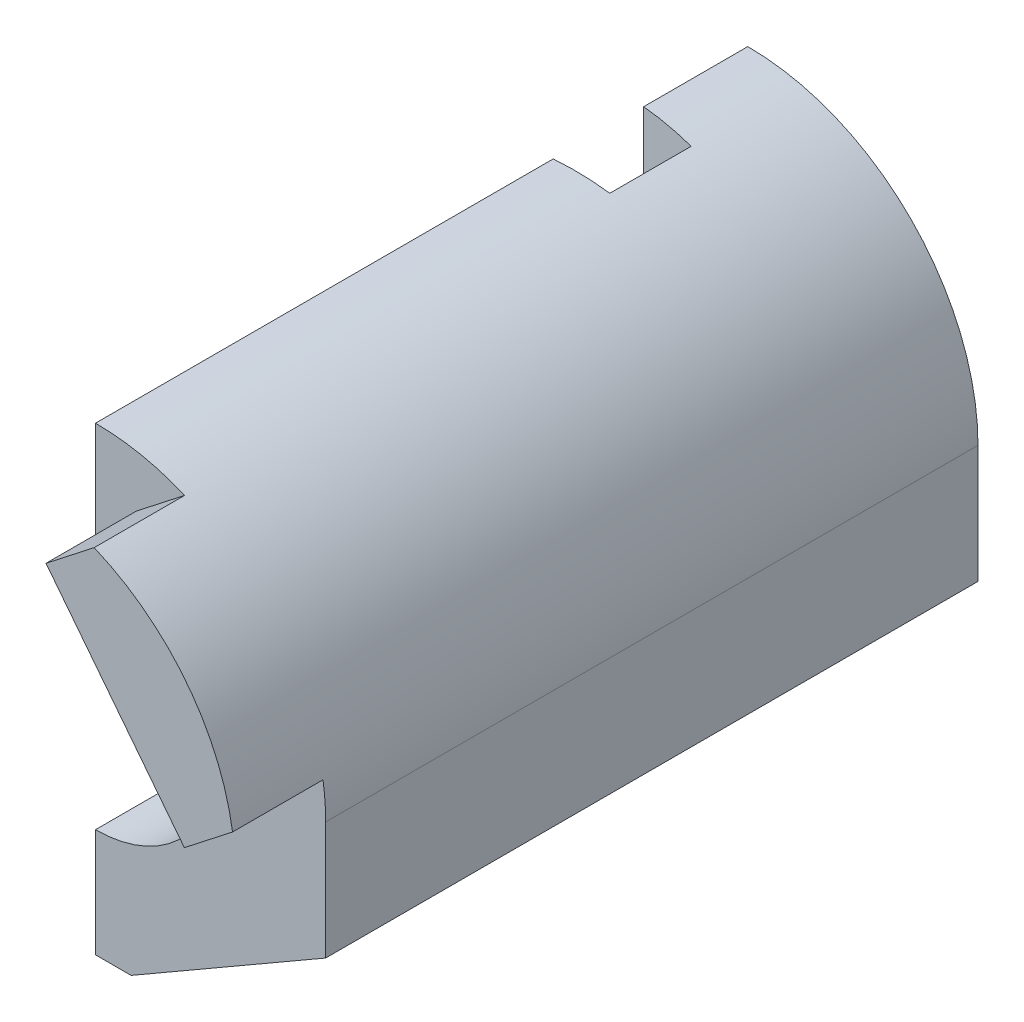
ISO-10303-21;
HEADER;
FILE_DESCRIPTION(('STEP AP214'),'2;1');
FILE_NAME('part.step','',(''),(''),'','','');
FILE_SCHEMA(('AUTOMOTIVE_DESIGN { 1 0 10303 214 1 1 1 1 }'));
ENDSEC;
DATA;
#1=APPLICATION_CONTEXT('core data for automotive mechanical design processes');
#2=APPLICATION_PROTOCOL_DEFINITION('international standard','automotive_design',2000,#1);
#3=PRODUCT_CONTEXT('',#1,'mechanical');
#4=PRODUCT('Part','Part','',(#3));
#5=PRODUCT_RELATED_PRODUCT_CATEGORY('part','',(#4));
#6=PRODUCT_DEFINITION_FORMATION('','',#4);
#7=PRODUCT_DEFINITION_CONTEXT('part definition',#1,'design');
#8=PRODUCT_DEFINITION('design','',#6,#7);
#9=PRODUCT_DEFINITION_SHAPE('','',#8);
#10=(LENGTH_UNIT() NAMED_UNIT(*) SI_UNIT(.MILLI.,.METRE.));
#11=(NAMED_UNIT(*) PLANE_ANGLE_UNIT() SI_UNIT($,.RADIAN.));
#12=(NAMED_UNIT(*) SI_UNIT($,.STERADIAN.) SOLID_ANGLE_UNIT());
#13=UNCERTAINTY_MEASURE_WITH_UNIT(LENGTH_MEASURE(1.E-05),#10,'distance_accuracy_value','');
#14=(GEOMETRIC_REPRESENTATION_CONTEXT(3) GLOBAL_UNCERTAINTY_ASSIGNED_CONTEXT((#13)) GLOBAL_UNIT_ASSIGNED_CONTEXT((#10,
#11,#12)) REPRESENTATION_CONTEXT('',''));
#15=CARTESIAN_POINT('',(0.,0.,0.));
#16=DIRECTION('',(0.,0.,1.));
#17=DIRECTION('',(1.,0.,0.));
#18=AXIS2_PLACEMENT_3D('',#15,#16,#17);
#19=CARTESIAN_POINT('',(20.,0.,238.));
#20=DIRECTION('',(0.,0.,-1.));
#21=DIRECTION('',(1.,0.,0.));
#22=AXIS2_PLACEMENT_3D('',#19,#20,#21);
#23=PLANE('',#22);
#24=DIRECTION('',(0.788010753606725,0.615661475325655,0.));
#25=VECTOR('',#24,1.);
#26=CARTESIAN_POINT('',(34.9464279455912,63.7071761394841,238.));
#27=LINE('',#26,#25);
#28=CARTESIAN_POINT('',(34.9464279455912,63.7071761394841,238.));
#29=VERTEX_POINT('',#28);
#30=CARTESIAN_POINT('',(52.5304084023254,77.4452873271054,238.));
#31=VERTEX_POINT('',#30);
#32=EDGE_CURVE('E204',#29,#31,#27,.T.);
#33=ORIENTED_EDGE('',*,*,#32,.T.);
#34=CARTESIAN_POINT('',(20.,0.,238.));
#35=DIRECTION('',(0.,0.,-1.));
#36=DIRECTION('',(1.,0.,0.));
#37=AXIS2_PLACEMENT_3D('',#34,#35,#36);
#38=CIRCLE('',#37,84.);
#39=CARTESIAN_POINT('',(20.,84.,238.));
#40=VERTEX_POINT('',#39);
#41=EDGE_CURVE('E284',#40,#31,#38,.T.);
#42=ORIENTED_EDGE('',*,*,#41,.F.);
#43=DIRECTION('',(0.,1.,0.));
#44=VECTOR('',#43,1.);
#45=CARTESIAN_POINT('',(20.,28.575,238.));
#46=LINE('',#45,#44);
#47=CARTESIAN_POINT('',(20.,44.45,238.));
#48=VERTEX_POINT('',#47);
#49=EDGE_CURVE('E280',#48,#40,#46,.T.);
#50=ORIENTED_EDGE('',*,*,#49,.F.);
#51=CARTESIAN_POINT('',(20.,0.,238.));
#52=DIRECTION('',(0.,0.,-1.));
#53=DIRECTION('',(-1.,0.,0.));
#54=AXIS2_PLACEMENT_3D('',#51,#52,#53);
#55=CIRCLE('',#54,44.45);
#56=CARTESIAN_POINT('',(20.,-44.45,238.));
#57=VERTEX_POINT('',#56);
#58=EDGE_CURVE('E255',#48,#57,#55,.T.);
#59=ORIENTED_EDGE('',*,*,#58,.T.);
#60=DIRECTION('',(0.,1.,0.));
#61=VECTOR('',#60,1.);
#62=CARTESIAN_POINT('',(20.,-84.,238.));
#63=LINE('',#62,#61);
#64=CARTESIAN_POINT('',(20.,-84.,238.));
#65=VERTEX_POINT('',#64);
#66=EDGE_CURVE('E277',#65,#57,#63,.T.);
#67=ORIENTED_EDGE('',*,*,#66,.F.);
#68=DIRECTION('',(-1.,0.,0.));
#69=VECTOR('',#68,1.);
#70=CARTESIAN_POINT('',(33.,-84.,238.));
#71=LINE('',#70,#69);
#72=CARTESIAN_POINT('',(33.,-84.,238.));
#73=VERTEX_POINT('',#72);
#74=EDGE_CURVE('E273',#73,#65,#71,.T.);
#75=ORIENTED_EDGE('',*,*,#74,.F.);
#76=DIRECTION('',(-0.866025403784442,-0.499999999999995,0.));
#77=VECTOR('',#76,1.);
#78=CARTESIAN_POINT('',(104.,-43.0081308875371,238.));
#79=LINE('',#78,#77);
#80=CARTESIAN_POINT('',(104.,-43.0081308875371,238.));
#81=VERTEX_POINT('',#80);
#82=EDGE_CURVE('E270',#81,#73,#79,.T.);
#83=ORIENTED_EDGE('',*,*,#82,.F.);
#84=DIRECTION('',(0.,-1.,0.));
#85=VECTOR('',#84,1.);
#86=CARTESIAN_POINT('',(104.,-43.0081308875371,238.));
#87=LINE('',#86,#85);
#88=CARTESIAN_POINT('',(104.,0.,238.));
#89=VERTEX_POINT('',#88);
#90=EDGE_CURVE('E286',#89,#81,#87,.T.);
#91=ORIENTED_EDGE('',*,*,#90,.F.);
#92=CARTESIAN_POINT('',(103.014649379029,12.8284055313539,238.));
#93=VERTEX_POINT('',#92);
#94=EDGE_CURVE('E283',#93,#89,#38,.T.);
#95=ORIENTED_EDGE('',*,*,#94,.F.);
#96=DIRECTION('',(-0.788010753606725,-0.615661475325655,0.));
#97=VECTOR('',#96,1.);
#98=CARTESIAN_POINT('',(103.014649379029,12.8284055313539,238.));
#99=LINE('',#98,#97);
#100=CARTESIAN_POINT('',(85.4306689222948,-0.909705656267424,238.));
#101=VERTEX_POINT('',#100);
#102=EDGE_CURVE('E196',#93,#101,#99,.T.);
#103=ORIENTED_EDGE('',*,*,#102,.T.);
#104=DIRECTION('',(-0.615661475325654,0.788010753606726,0.));
#105=VECTOR('',#104,1.);
#106=CARTESIAN_POINT('',(85.4306689222948,-0.909705656267424,238.));
#107=LINE('',#106,#105);
#108=EDGE_CURVE('E207',#101,#29,#107,.T.);
#109=ORIENTED_EDGE('',*,*,#108,.T.);
#110=EDGE_LOOP('',(#33,#42,#50,#59,#67,#75,#83,#91,#95,#103,#109));
#111=FACE_BOUND('',#110,.T.);
#112=ADVANCED_FACE('F40',(#111),#23,.F.);
#113=CARTESIAN_POINT('',(20.,28.575,238.));
#114=DIRECTION('',(1.,0.,0.));
#115=DIRECTION('',(0.,0.,1.));
#116=AXIS2_PLACEMENT_3D('',#113,#114,#115);
#117=PLANE('',#116);
#118=DIRECTION('',(0.,0.,-1.));
#119=VECTOR('',#118,1.);
#120=CARTESIAN_POINT('',(20.,28.575,238.));
#121=LINE('',#120,#119);
#122=CARTESIAN_POINT('',(20.,28.575,160.));
#123=VERTEX_POINT('',#122);
#124=CARTESIAN_POINT('',(20.,28.575,71.));
#125=VERTEX_POINT('',#124);
#126=EDGE_CURVE('E319',#123,#125,#121,.T.);
#127=ORIENTED_EDGE('',*,*,#126,.F.);
#128=DIRECTION('',(0.,1.,0.));
#129=VECTOR('',#128,1.);
#130=CARTESIAN_POINT('',(20.,28.575,160.));
#131=LINE('',#130,#129);
#132=CARTESIAN_POINT('',(20.,44.45,160.));
#133=VERTEX_POINT('',#132);
#134=EDGE_CURVE('E331',#123,#133,#131,.T.);
#135=ORIENTED_EDGE('',*,*,#134,.T.);
#136=DIRECTION('',(0.,0.,1.));
#137=VECTOR('',#136,1.);
#138=CARTESIAN_POINT('',(20.,44.45,160.));
#139=LINE('',#138,#137);
#140=EDGE_CURVE('E258',#48,#133,#139,.F.);
#141=ORIENTED_EDGE('',*,*,#140,.F.);
#142=ORIENTED_EDGE('',*,*,#49,.T.);
#143=DIRECTION('',(0.,0.,-1.));
#144=VECTOR('',#143,1.);
#145=CARTESIAN_POINT('',(20.,84.,238.));
#146=LINE('',#145,#144);
#147=CARTESIAN_POINT('',(20.,84.,71.));
#148=VERTEX_POINT('',#147);
#149=EDGE_CURVE('E315',#40,#148,#146,.T.);
#150=ORIENTED_EDGE('',*,*,#149,.T.);
#151=DIRECTION('',(0.,-1.,0.));
#152=VECTOR('',#151,1.);
#153=CARTESIAN_POINT('',(20.,86.,71.));
#154=LINE('',#153,#152);
#155=EDGE_CURVE('E236',#148,#125,#154,.T.);
#156=ORIENTED_EDGE('',*,*,#155,.T.);
#157=EDGE_LOOP('',(#127,#135,#141,#142,#150,#156));
#158=FACE_BOUND('',#157,.T.);
#159=ADVANCED_FACE('F403',(#158),#117,.F.);
#160=CARTESIAN_POINT('',(20.,0.,238.));
#161=DIRECTION('',(0.,0.,-1.));
#162=DIRECTION('',(1.,0.,0.));
#163=AXIS2_PLACEMENT_3D('',#160,#161,#162);
#164=CYLINDRICAL_SURFACE('',#163,28.575);
#165=DIRECTION('',(0.,0.,-1.));
#166=VECTOR('',#165,1.);
#167=CARTESIAN_POINT('',(39.,21.3431634253219,238.));
#168=LINE('',#167,#166);
#169=CARTESIAN_POINT('',(39.,21.3431634253219,69.3377153930074));
#170=VERTEX_POINT('',#169);
#171=CARTESIAN_POINT('',(39.,21.3431634253219,39.6622846069926));
#172=VERTEX_POINT('',#171);
#173=EDGE_CURVE('E247',#170,#172,#168,.T.);
#174=ORIENTED_EDGE('',*,*,#173,.T.);
#175=CARTESIAN_POINT('',(20.,0.,38.));
#176=DIRECTION('',(-0.0871557427476584,0.,0.996194698091746));
#177=DIRECTION('',(-0.996194698091746,0.,-0.0871557427476584));
#178=AXIS2_PLACEMENT_3D('',#175,#176,#177);
#179=ELLIPSE('',#178,28.6841518578012,28.575);
#180=CARTESIAN_POINT('',(20.,28.575,38.));
#181=VERTEX_POINT('',#180);
#182=EDGE_CURVE('E250',#181,#172,#179,.F.);
#183=ORIENTED_EDGE('',*,*,#182,.F.);
#184=CARTESIAN_POINT('',(20.,28.575,0.));
#185=VERTEX_POINT('',#184);
#186=EDGE_CURVE('E318',#181,#185,#121,.T.);
#187=ORIENTED_EDGE('',*,*,#186,.T.);
#188=CARTESIAN_POINT('',(20.,0.,0.));
#189=DIRECTION('',(0.,0.,1.));
#190=DIRECTION('',(1.,0.,0.));
#191=AXIS2_PLACEMENT_3D('',#188,#189,#190);
#192=CIRCLE('',#191,28.575);
#193=CARTESIAN_POINT('',(20.,-28.575,0.));
#194=VERTEX_POINT('',#193);
#195=EDGE_CURVE('E299',#194,#185,#192,.T.);
#196=ORIENTED_EDGE('',*,*,#195,.F.);
#197=DIRECTION('',(0.,0.,-1.));
#198=VECTOR('',#197,1.);
#199=CARTESIAN_POINT('',(20.,-28.575,238.));
#200=LINE('',#199,#198);
#201=CARTESIAN_POINT('',(20.,-28.575,160.));
#202=VERTEX_POINT('',#201);
#203=EDGE_CURVE('E322',#202,#194,#200,.T.);
#204=ORIENTED_EDGE('',*,*,#203,.F.);
#205=CARTESIAN_POINT('',(20.,0.,160.));
#206=DIRECTION('',(0.,0.,-1.));
#207=DIRECTION('',(-1.,0.,0.));
#208=AXIS2_PLACEMENT_3D('',#205,#206,#207);
#209=CIRCLE('',#208,28.575);
#210=EDGE_CURVE('E265',#202,#123,#209,.F.);
#211=ORIENTED_EDGE('',*,*,#210,.T.);
#212=ORIENTED_EDGE('',*,*,#126,.T.);
#213=CARTESIAN_POINT('',(20.,0.,71.));
#214=DIRECTION('',(-0.0871557427476584,0.,-0.996194698091746));
#215=DIRECTION('',(0.996194698091746,0.,-0.0871557427476584));
#216=AXIS2_PLACEMENT_3D('',#213,#214,#215);
#217=ELLIPSE('',#216,28.6841518578012,28.575);
#218=EDGE_CURVE('E253',#170,#125,#217,.F.);
#219=ORIENTED_EDGE('',*,*,#218,.F.);
#220=EDGE_LOOP('',(#174,#183,#187,#196,#204,#211,#212,#219));
#221=FACE_BOUND('',#220,.T.);
#222=ADVANCED_FACE('F370',(#221),#164,.F.);
#223=CARTESIAN_POINT('',(104.,-43.0081308875371,238.));
#224=DIRECTION('',(-0.499999999999995,0.866025403784442,0.));
#225=DIRECTION('',(0.866025403784442,0.499999999999995,0.));
#226=AXIS2_PLACEMENT_3D('',#223,#224,#225);
#227=PLANE('',#226);
#228=DIRECTION('',(-0.866025403784442,-0.499999999999995,0.));
#229=VECTOR('',#228,1.);
#230=CARTESIAN_POINT('',(104.,-43.0081308875371,0.));
#231=LINE('',#230,#229);
#232=CARTESIAN_POINT('',(104.,-43.0081308875371,0.));
#233=VERTEX_POINT('',#232);
#234=CARTESIAN_POINT('',(33.,-84.,0.));
#235=VERTEX_POINT('',#234);
#236=EDGE_CURVE('E269',#233,#235,#231,.T.);
#237=ORIENTED_EDGE('',*,*,#236,.F.);
#238=DIRECTION('',(0.,0.,-1.));
#239=VECTOR('',#238,1.);
#240=CARTESIAN_POINT('',(104.,-43.0081308875371,238.));
#241=LINE('',#240,#239);
#242=EDGE_CURVE('E289',#81,#233,#241,.T.);
#243=ORIENTED_EDGE('',*,*,#242,.F.);
#244=ORIENTED_EDGE('',*,*,#82,.T.);
#245=DIRECTION('',(0.,0.,-1.));
#246=VECTOR('',#245,1.);
#247=CARTESIAN_POINT('',(33.,-84.,238.));
#248=LINE('',#247,#246);
#249=EDGE_CURVE('E328',#73,#235,#248,.T.);
#250=ORIENTED_EDGE('',*,*,#249,.T.);
#251=EDGE_LOOP('',(#237,#243,#244,#250));
#252=FACE_BOUND('',#251,.T.);
#253=ADVANCED_FACE('F42',(#252),#227,.F.);
#254=CARTESIAN_POINT('',(33.,-84.,238.));
#255=DIRECTION('',(0.,1.,0.));
#256=DIRECTION('',(0.,0.,1.));
#257=AXIS2_PLACEMENT_3D('',#254,#255,#256);
#258=PLANE('',#257);
#259=DIRECTION('',(-1.,0.,0.));
#260=VECTOR('',#259,1.);
#261=CARTESIAN_POINT('',(33.,-84.,0.));
#262=LINE('',#261,#260);
#263=CARTESIAN_POINT('',(20.,-84.,0.));
#264=VERTEX_POINT('',#263);
#265=EDGE_CURVE('E292',#235,#264,#262,.T.);
#266=ORIENTED_EDGE('',*,*,#265,.F.);
#267=ORIENTED_EDGE('',*,*,#249,.F.);
#268=ORIENTED_EDGE('',*,*,#74,.T.);
#269=DIRECTION('',(0.,0.,-1.));
#270=VECTOR('',#269,1.);
#271=CARTESIAN_POINT('',(20.,-84.,238.));
#272=LINE('',#271,#270);
#273=EDGE_CURVE('E325',#65,#264,#272,.T.);
#274=ORIENTED_EDGE('',*,*,#273,.T.);
#275=EDGE_LOOP('',(#266,#267,#268,#274));
#276=FACE_BOUND('',#275,.T.);
#277=ADVANCED_FACE('F384',(#276),#258,.F.);
#278=CARTESIAN_POINT('',(20.,-84.,238.));
#279=DIRECTION('',(1.,0.,0.));
#280=DIRECTION('',(0.,0.,1.));
#281=AXIS2_PLACEMENT_3D('',#278,#279,#280);
#282=PLANE('',#281);
#283=CARTESIAN_POINT('',(20.,-58.,117.));
#284=DIRECTION('',(1.,0.,0.));
#285=DIRECTION('',(0.,1.,0.));
#286=AXIS2_PLACEMENT_3D('',#283,#284,#285);
#287=CIRCLE('',#286,11.);
#288=CARTESIAN_POINT('',(20.,-47.,117.));
#289=VERTEX_POINT('',#288);
#290=CARTESIAN_POINT('',(20.,-69.,117.));
#291=VERTEX_POINT('',#290);
#292=EDGE_CURVE('E198',#289,#291,#287,.T.);
#293=ORIENTED_EDGE('',*,*,#292,.T.);
#294=DIRECTION('',(0.,0.,-1.));
#295=VECTOR('',#294,1.);
#296=CARTESIAN_POINT('',(20.,-69.,117.));
#297=LINE('',#296,#295);
#298=CARTESIAN_POINT('',(20.,-69.,0.));
#299=VERTEX_POINT('',#298);
#300=EDGE_CURVE('E229',#291,#299,#297,.T.);
#301=ORIENTED_EDGE('',*,*,#300,.T.);
#302=DIRECTION('',(0.,1.,0.));
#303=VECTOR('',#302,1.);
#304=CARTESIAN_POINT('',(20.,-84.,0.));
#305=LINE('',#304,#303);
#306=EDGE_CURVE('E296',#264,#299,#305,.T.);
#307=ORIENTED_EDGE('',*,*,#306,.F.);
#308=ORIENTED_EDGE('',*,*,#273,.F.);
#309=ORIENTED_EDGE('',*,*,#66,.T.);
#310=DIRECTION('',(0.,0.,1.));
#311=VECTOR('',#310,1.);
#312=CARTESIAN_POINT('',(20.,-44.45,160.));
#313=LINE('',#312,#311);
#314=CARTESIAN_POINT('',(20.,-44.45,160.));
#315=VERTEX_POINT('',#314);
#316=EDGE_CURVE('E263',#315,#57,#313,.T.);
#317=ORIENTED_EDGE('',*,*,#316,.F.);
#318=DIRECTION('',(0.,1.,0.));
#319=VECTOR('',#318,1.);
#320=CARTESIAN_POINT('',(20.,-84.,160.));
#321=LINE('',#320,#319);
#322=EDGE_CURVE('E267',#315,#202,#321,.T.);
#323=ORIENTED_EDGE('',*,*,#322,.T.);
#324=ORIENTED_EDGE('',*,*,#203,.T.);
#325=CARTESIAN_POINT('',(20.,-47.,0.));
#326=VERTEX_POINT('',#325);
#327=EDGE_CURVE('E295',#326,#194,#305,.T.);
#328=ORIENTED_EDGE('',*,*,#327,.F.);
#329=DIRECTION('',(0.,0.,1.));
#330=VECTOR('',#329,1.);
#331=CARTESIAN_POINT('',(20.,-47.,117.));
#332=LINE('',#331,#330);
#333=EDGE_CURVE('E222',#326,#289,#332,.T.);
#334=ORIENTED_EDGE('',*,*,#333,.T.);
#335=EDGE_LOOP('',(#293,#301,#307,#308,#309,#317,#323,#324,#328,#334));
#336=FACE_BOUND('',#335,.T.);
#337=ADVANCED_FACE('F365',(#336),#282,.F.);
#338=CARTESIAN_POINT('',(20.,84.,38.));
#339=VERTEX_POINT('',#338);
#340=CARTESIAN_POINT('',(20.,84.,0.));
#341=VERTEX_POINT('',#340);
#342=EDGE_CURVE('E314',#339,#341,#146,.T.);
#343=ORIENTED_EDGE('',*,*,#342,.T.);
#344=DIRECTION('',(0.,1.,0.));
#345=VECTOR('',#344,1.);
#346=CARTESIAN_POINT('',(20.,28.575,0.));
#347=LINE('',#346,#345);
#348=EDGE_CURVE('E302',#185,#341,#347,.T.);
#349=ORIENTED_EDGE('',*,*,#348,.F.);
#350=ORIENTED_EDGE('',*,*,#186,.F.);
#351=DIRECTION('',(0.,1.,0.));
#352=VECTOR('',#351,1.);
#353=CARTESIAN_POINT('',(20.,86.,38.));
#354=LINE('',#353,#352);
#355=EDGE_CURVE('E240',#181,#339,#354,.T.);
#356=ORIENTED_EDGE('',*,*,#355,.T.);
#357=EDGE_LOOP('',(#343,#349,#350,#356));
#358=FACE_BOUND('',#357,.T.);
#359=ADVANCED_FACE('F375',(#358),#117,.F.);
#360=CARTESIAN_POINT('',(20.,0.,238.));
#361=DIRECTION('',(0.,0.,-1.));
#362=DIRECTION('',(1.,0.,0.));
#363=AXIS2_PLACEMENT_3D('',#360,#361,#362);
#364=CYLINDRICAL_SURFACE('',#363,84.);
#365=ORIENTED_EDGE('',*,*,#149,.F.);
#366=ORIENTED_EDGE('',*,*,#41,.T.);
#367=DIRECTION('',(0.,0.,-1.));
#368=VECTOR('',#367,1.);
#369=CARTESIAN_POINT('',(52.5304084023254,77.4452873271054,271.));
#370=LINE('',#369,#368);
#371=CARTESIAN_POINT('',(52.5304084023254,77.4452873271054,271.));
#372=VERTEX_POINT('',#371);
#373=EDGE_CURVE('E203',#372,#31,#370,.T.);
#374=ORIENTED_EDGE('',*,*,#373,.F.);
#375=CARTESIAN_POINT('',(20.,0.,271.));
#376=DIRECTION('',(0.,0.,-1.));
#377=DIRECTION('',(-1.,0.,0.));
#378=AXIS2_PLACEMENT_3D('',#375,#376,#377);
#379=CIRCLE('',#378,84.);
#380=CARTESIAN_POINT('',(103.014649379029,12.8284055313539,271.));
#381=VERTEX_POINT('',#380);
#382=EDGE_CURVE('E188',#372,#381,#379,.T.);
#383=ORIENTED_EDGE('',*,*,#382,.T.);
#384=DIRECTION('',(0.,0.,-1.));
#385=VECTOR('',#384,1.);
#386=CARTESIAN_POINT('',(103.014649379029,12.8284055313539,271.));
#387=LINE('',#386,#385);
#388=EDGE_CURVE('E63',#381,#93,#387,.T.);
#389=ORIENTED_EDGE('',*,*,#388,.T.);
#390=ORIENTED_EDGE('',*,*,#94,.T.);
#391=DIRECTION('',(0.,0.,-1.));
#392=VECTOR('',#391,1.);
#393=CARTESIAN_POINT('',(104.,0.,238.));
#394=LINE('',#393,#392);
#395=CARTESIAN_POINT('',(104.,0.,0.));
#396=VERTEX_POINT('',#395);
#397=EDGE_CURVE('E311',#89,#396,#394,.T.);
#398=ORIENTED_EDGE('',*,*,#397,.T.);
#399=CARTESIAN_POINT('',(20.,0.,0.));
#400=DIRECTION('',(0.,0.,-1.));
#401=DIRECTION('',(1.,0.,0.));
#402=AXIS2_PLACEMENT_3D('',#399,#400,#401);
#403=CIRCLE('',#402,84.);
#404=EDGE_CURVE('E305',#341,#396,#403,.T.);
#405=ORIENTED_EDGE('',*,*,#404,.F.);
#406=ORIENTED_EDGE('',*,*,#342,.F.);
#407=CARTESIAN_POINT('',(20.,0.,38.));
#408=DIRECTION('',(-0.0871557427476584,0.,0.996194698091746));
#409=DIRECTION('',(-0.996194698091746,0.,-0.0871557427476584));
#410=AXIS2_PLACEMENT_3D('',#407,#408,#409);
#411=ELLIPSE('',#410,84.3208663536412,84.);
#412=CARTESIAN_POINT('',(39.,81.8229796573065,39.6622846069925));
#413=VERTEX_POINT('',#412);
#414=EDGE_CURVE('E337',#413,#339,#411,.T.);
#415=ORIENTED_EDGE('',*,*,#414,.F.);
#416=DIRECTION('',(0.,0.,-1.));
#417=VECTOR('',#416,1.);
#418=CARTESIAN_POINT('',(39.,81.8229796573065,238.));
#419=LINE('',#418,#417);
#420=CARTESIAN_POINT('',(39.,81.8229796573065,69.3377153930075));
#421=VERTEX_POINT('',#420);
#422=EDGE_CURVE('E334',#413,#421,#419,.F.);
#423=ORIENTED_EDGE('',*,*,#422,.T.);
#424=CARTESIAN_POINT('',(20.,0.,71.));
#425=DIRECTION('',(-0.0871557427476584,0.,-0.996194698091746));
#426=DIRECTION('',(0.996194698091746,0.,-0.0871557427476584));
#427=AXIS2_PLACEMENT_3D('',#424,#425,#426);
#428=ELLIPSE('',#427,84.3208663536412,84.);
#429=EDGE_CURVE('E339',#148,#421,#428,.T.);
#430=ORIENTED_EDGE('',*,*,#429,.F.);
#431=EDGE_LOOP('',(#365,#366,#374,#383,#389,#390,#398,#405,#406,#415,#423,#430));
#432=FACE_BOUND('',#431,.T.);
#433=ADVANCED_FACE('F201',(#432),#364,.T.);
#434=CARTESIAN_POINT('',(104.,-43.0081308875371,238.));
#435=DIRECTION('',(-1.,0.,0.));
#436=DIRECTION('',(0.,1.,0.));
#437=AXIS2_PLACEMENT_3D('',#434,#435,#436);
#438=PLANE('',#437);
#439=DIRECTION('',(0.,-1.,0.));
#440=VECTOR('',#439,1.);
#441=CARTESIAN_POINT('',(104.,-43.0081308875371,0.));
#442=LINE('',#441,#440);
#443=EDGE_CURVE('E274',#396,#233,#442,.T.);
#444=ORIENTED_EDGE('',*,*,#443,.F.);
#445=ORIENTED_EDGE('',*,*,#397,.F.);
#446=ORIENTED_EDGE('',*,*,#90,.T.);
#447=ORIENTED_EDGE('',*,*,#242,.T.);
#448=EDGE_LOOP('',(#444,#445,#446,#447));
#449=FACE_BOUND('',#448,.T.);
#450=ADVANCED_FACE('F379',(#449),#438,.F.);
#451=CARTESIAN_POINT('',(20.,0.,0.));
#452=DIRECTION('',(0.,0.,-1.));
#453=DIRECTION('',(1.,0.,0.));
#454=AXIS2_PLACEMENT_3D('',#451,#452,#453);
#455=PLANE('',#454);
#456=DIRECTION('',(-1.,0.,0.));
#457=VECTOR('',#456,1.);
#458=CARTESIAN_POINT('',(20.,-47.,0.));
#459=LINE('',#458,#457);
#460=CARTESIAN_POINT('',(33.,-47.,0.));
#461=VERTEX_POINT('',#460);
#462=EDGE_CURVE('E11',#461,#326,#459,.T.);
#463=ORIENTED_EDGE('',*,*,#462,.T.);
#464=ORIENTED_EDGE('',*,*,#327,.T.);
#465=ORIENTED_EDGE('',*,*,#195,.T.);
#466=ORIENTED_EDGE('',*,*,#348,.T.);
#467=ORIENTED_EDGE('',*,*,#404,.T.);
#468=ORIENTED_EDGE('',*,*,#443,.T.);
#469=ORIENTED_EDGE('',*,*,#236,.T.);
#470=ORIENTED_EDGE('',*,*,#265,.T.);
#471=ORIENTED_EDGE('',*,*,#306,.T.);
#472=DIRECTION('',(1.,0.,0.));
#473=VECTOR('',#472,1.);
#474=CARTESIAN_POINT('',(20.,-69.,0.));
#475=LINE('',#474,#473);
#476=CARTESIAN_POINT('',(33.,-69.,0.));
#477=VERTEX_POINT('',#476);
#478=EDGE_CURVE('E48',#299,#477,#475,.T.);
#479=ORIENTED_EDGE('',*,*,#478,.T.);
#480=DIRECTION('',(0.,-1.,0.));
#481=VECTOR('',#480,1.);
#482=CARTESIAN_POINT('',(33.,0.,0.));
#483=LINE('',#482,#481);
#484=EDGE_CURVE('E342',#461,#477,#483,.T.);
#485=ORIENTED_EDGE('',*,*,#484,.F.);
#486=EDGE_LOOP('',(#463,#464,#465,#466,#467,#468,#469,#470,#471,#479,#485));
#487=FACE_BOUND('',#486,.T.);
#488=ADVANCED_FACE('F347',(#487),#455,.T.);
#489=CARTESIAN_POINT('',(20.,0.,160.));
#490=DIRECTION('',(0.,0.,1.));
#491=DIRECTION('',(-1.,0.,0.));
#492=AXIS2_PLACEMENT_3D('',#489,#490,#491);
#493=PLANE('',#492);
#494=ORIENTED_EDGE('',*,*,#322,.F.);
#495=CARTESIAN_POINT('',(20.,0.,160.));
#496=DIRECTION('',(0.,0.,-1.));
#497=DIRECTION('',(-1.,0.,0.));
#498=AXIS2_PLACEMENT_3D('',#495,#496,#497);
#499=CIRCLE('',#498,44.45);
#500=EDGE_CURVE('E256',#133,#315,#499,.T.);
#501=ORIENTED_EDGE('',*,*,#500,.F.);
#502=ORIENTED_EDGE('',*,*,#134,.F.);
#503=ORIENTED_EDGE('',*,*,#210,.F.);
#504=EDGE_LOOP('',(#494,#501,#502,#503));
#505=FACE_BOUND('',#504,.T.);
#506=ADVANCED_FACE('F417',(#505),#493,.T.);
#507=CARTESIAN_POINT('',(20.,0.,160.));
#508=DIRECTION('',(0.,0.,1.));
#509=DIRECTION('',(-1.,0.,0.));
#510=AXIS2_PLACEMENT_3D('',#507,#508,#509);
#511=CYLINDRICAL_SURFACE('',#510,44.45);
#512=ORIENTED_EDGE('',*,*,#500,.T.);
#513=ORIENTED_EDGE('',*,*,#316,.T.);
#514=ORIENTED_EDGE('',*,*,#58,.F.);
#515=ORIENTED_EDGE('',*,*,#140,.T.);
#516=EDGE_LOOP('',(#512,#513,#514,#515));
#517=FACE_BOUND('',#516,.T.);
#518=ADVANCED_FACE('F413',(#517),#511,.F.);
#519=CARTESIAN_POINT('',(20.,86.,71.));
#520=DIRECTION('',(0.0871557427476584,0.,0.996194698091746));
#521=DIRECTION('',(-0.996194698091746,0.,0.0871557427476584));
#522=AXIS2_PLACEMENT_3D('',#519,#520,#521);
#523=PLANE('',#522);
#524=DIRECTION('',(0.,-1.,0.));
#525=VECTOR('',#524,1.);
#526=CARTESIAN_POINT('',(39.,0.,69.3377153930074));
#527=LINE('',#526,#525);
#528=EDGE_CURVE('E243',#421,#170,#527,.T.);
#529=ORIENTED_EDGE('',*,*,#528,.T.);
#530=ORIENTED_EDGE('',*,*,#218,.T.);
#531=ORIENTED_EDGE('',*,*,#155,.F.);
#532=ORIENTED_EDGE('',*,*,#429,.T.);
#533=EDGE_LOOP('',(#529,#530,#531,#532));
#534=FACE_BOUND('',#533,.T.);
#535=ADVANCED_FACE('F517',(#534),#523,.F.);
#536=CARTESIAN_POINT('',(20.,86.,38.));
#537=DIRECTION('',(0.0871557427476584,0.,-0.996194698091746));
#538=DIRECTION('',(0.996194698091746,0.,0.0871557427476584));
#539=AXIS2_PLACEMENT_3D('',#536,#537,#538);
#540=PLANE('',#539);
#541=ORIENTED_EDGE('',*,*,#355,.F.);
#542=ORIENTED_EDGE('',*,*,#182,.T.);
#543=DIRECTION('',(0.,1.,0.));
#544=VECTOR('',#543,1.);
#545=CARTESIAN_POINT('',(39.,0.,39.6622846069925));
#546=LINE('',#545,#544);
#547=EDGE_CURVE('E245',#172,#413,#546,.T.);
#548=ORIENTED_EDGE('',*,*,#547,.T.);
#549=ORIENTED_EDGE('',*,*,#414,.T.);
#550=EDGE_LOOP('',(#541,#542,#548,#549));
#551=FACE_BOUND('',#550,.T.);
#552=ADVANCED_FACE('F398',(#551),#540,.F.);
#553=CARTESIAN_POINT('',(39.,0.,0.));
#554=DIRECTION('',(-1.,0.,0.));
#555=DIRECTION('',(0.,0.,-1.));
#556=AXIS2_PLACEMENT_3D('',#553,#554,#555);
#557=PLANE('',#556);
#558=ORIENTED_EDGE('',*,*,#173,.F.);
#559=ORIENTED_EDGE('',*,*,#528,.F.);
#560=ORIENTED_EDGE('',*,*,#422,.F.);
#561=ORIENTED_EDGE('',*,*,#547,.F.);
#562=EDGE_LOOP('',(#558,#559,#560,#561));
#563=FACE_BOUND('',#562,.T.);
#564=ADVANCED_FACE('F391',(#563),#557,.T.);
#565=CARTESIAN_POINT('',(33.,-58.,117.));
#566=DIRECTION('',(-1.,0.,0.));
#567=DIRECTION('',(0.,1.,0.));
#568=AXIS2_PLACEMENT_3D('',#565,#566,#567);
#569=CYLINDRICAL_SURFACE('',#568,11.);
#570=ORIENTED_EDGE('',*,*,#292,.F.);
#571=DIRECTION('',(-1.,0.,0.));
#572=VECTOR('',#571,1.);
#573=CARTESIAN_POINT('',(33.,-47.,117.));
#574=LINE('',#573,#572);
#575=CARTESIAN_POINT('',(33.,-47.,117.));
#576=VERTEX_POINT('',#575);
#577=EDGE_CURVE('E234',#576,#289,#574,.T.);
#578=ORIENTED_EDGE('',*,*,#577,.F.);
#579=CARTESIAN_POINT('',(33.,-58.,117.));
#580=DIRECTION('',(1.,0.,0.));
#581=DIRECTION('',(0.,1.,0.));
#582=AXIS2_PLACEMENT_3D('',#579,#580,#581);
#583=CIRCLE('',#582,11.);
#584=CARTESIAN_POINT('',(33.,-69.,117.));
#585=VERTEX_POINT('',#584);
#586=EDGE_CURVE('E218',#576,#585,#583,.T.);
#587=ORIENTED_EDGE('',*,*,#586,.T.);
#588=DIRECTION('',(-1.,0.,0.));
#589=VECTOR('',#588,1.);
#590=CARTESIAN_POINT('',(33.,-69.,117.));
#591=LINE('',#590,#589);
#592=EDGE_CURVE('E226',#585,#291,#591,.T.);
#593=ORIENTED_EDGE('',*,*,#592,.T.);
#594=EDGE_LOOP('',(#570,#578,#587,#593));
#595=FACE_BOUND('',#594,.T.);
#596=ADVANCED_FACE('F389',(#595),#569,.F.);
#597=CARTESIAN_POINT('',(33.,-47.,117.));
#598=DIRECTION('',(0.,1.,0.));
#599=DIRECTION('',(1.,0.,0.));
#600=AXIS2_PLACEMENT_3D('',#597,#598,#599);
#601=PLANE('',#600);
#602=ORIENTED_EDGE('',*,*,#462,.F.);
#603=DIRECTION('',(0.,0.,1.));
#604=VECTOR('',#603,1.);
#605=CARTESIAN_POINT('',(33.,-47.,117.));
#606=LINE('',#605,#604);
#607=EDGE_CURVE('E224',#461,#576,#606,.T.);
#608=ORIENTED_EDGE('',*,*,#607,.T.);
#609=ORIENTED_EDGE('',*,*,#577,.T.);
#610=ORIENTED_EDGE('',*,*,#333,.F.);
#611=EDGE_LOOP('',(#602,#608,#609,#610));
#612=FACE_BOUND('',#611,.T.);
#613=ADVANCED_FACE('F358',(#612),#601,.F.);
#614=CARTESIAN_POINT('',(33.,-69.,117.));
#615=DIRECTION('',(0.,-1.,0.));
#616=DIRECTION('',(-1.,0.,0.));
#617=AXIS2_PLACEMENT_3D('',#614,#615,#616);
#618=PLANE('',#617);
#619=ORIENTED_EDGE('',*,*,#478,.F.);
#620=ORIENTED_EDGE('',*,*,#300,.F.);
#621=ORIENTED_EDGE('',*,*,#592,.F.);
#622=DIRECTION('',(0.,0.,-1.));
#623=VECTOR('',#622,1.);
#624=CARTESIAN_POINT('',(33.,-69.,117.));
#625=LINE('',#624,#623);
#626=EDGE_CURVE('E221',#585,#477,#625,.T.);
#627=ORIENTED_EDGE('',*,*,#626,.T.);
#628=EDGE_LOOP('',(#619,#620,#621,#627));
#629=FACE_BOUND('',#628,.T.);
#630=ADVANCED_FACE('F351',(#629),#618,.F.);
#631=CARTESIAN_POINT('',(33.,-58.,117.));
#632=DIRECTION('',(-1.,0.,0.));
#633=DIRECTION('',(0.,1.,0.));
#634=AXIS2_PLACEMENT_3D('',#631,#632,#633);
#635=PLANE('',#634);
#636=ORIENTED_EDGE('',*,*,#607,.F.);
#637=ORIENTED_EDGE('',*,*,#484,.T.);
#638=ORIENTED_EDGE('',*,*,#626,.F.);
#639=ORIENTED_EDGE('',*,*,#586,.F.);
#640=EDGE_LOOP('',(#636,#637,#638,#639));
#641=FACE_BOUND('',#640,.T.);
#642=ADVANCED_FACE('F355',(#641),#635,.T.);
#643=CARTESIAN_POINT('',(103.014649379029,12.8284055313539,271.));
#644=DIRECTION('',(-0.615661475325655,0.788010753606725,0.));
#645=DIRECTION('',(0.788010753606725,0.615661475325655,0.));
#646=AXIS2_PLACEMENT_3D('',#643,#644,#645);
#647=PLANE('',#646);
#648=ORIENTED_EDGE('',*,*,#102,.F.);
#649=ORIENTED_EDGE('',*,*,#388,.F.);
#650=DIRECTION('',(-0.788010753606725,-0.615661475325655,0.));
#651=VECTOR('',#650,1.);
#652=CARTESIAN_POINT('',(103.014649379029,12.8284055313539,271.));
#653=LINE('',#652,#651);
#654=CARTESIAN_POINT('',(85.4306689222948,-0.909705656267424,271.));
#655=VERTEX_POINT('',#654);
#656=EDGE_CURVE('E186',#381,#655,#653,.T.);
#657=ORIENTED_EDGE('',*,*,#656,.T.);
#658=DIRECTION('',(0.,0.,-1.));
#659=VECTOR('',#658,1.);
#660=CARTESIAN_POINT('',(85.4306689222948,-0.909705656267424,271.));
#661=LINE('',#660,#659);
#662=EDGE_CURVE('E199',#655,#101,#661,.T.);
#663=ORIENTED_EDGE('',*,*,#662,.T.);
#664=EDGE_LOOP('',(#648,#649,#657,#663));
#665=FACE_BOUND('',#664,.T.);
#666=ADVANCED_FACE('F194',(#665),#647,.F.);
#667=CARTESIAN_POINT('',(85.4306689222948,-0.909705656267424,271.));
#668=DIRECTION('',(0.788010753606726,0.615661475325654,0.));
#669=DIRECTION('',(0.615661475325654,-0.788010753606726,0.));
#670=AXIS2_PLACEMENT_3D('',#667,#668,#669);
#671=PLANE('',#670);
#672=ORIENTED_EDGE('',*,*,#108,.F.);
#673=ORIENTED_EDGE('',*,*,#662,.F.);
#674=DIRECTION('',(-0.615661475325654,0.788010753606726,0.));
#675=VECTOR('',#674,1.);
#676=CARTESIAN_POINT('',(85.4306689222948,-0.909705656267424,271.));
#677=LINE('',#676,#675);
#678=CARTESIAN_POINT('',(34.9464279455912,63.7071761394841,271.));
#679=VERTEX_POINT('',#678);
#680=EDGE_CURVE('E190',#655,#679,#677,.T.);
#681=ORIENTED_EDGE('',*,*,#680,.T.);
#682=DIRECTION('',(0.,0.,-1.));
#683=VECTOR('',#682,1.);
#684=CARTESIAN_POINT('',(34.9464279455912,63.7071761394841,271.));
#685=LINE('',#684,#683);
#686=EDGE_CURVE('E55',#679,#29,#685,.T.);
#687=ORIENTED_EDGE('',*,*,#686,.T.);
#688=EDGE_LOOP('',(#672,#673,#681,#687));
#689=FACE_BOUND('',#688,.T.);
#690=ADVANCED_FACE('F585',(#689),#671,.F.);
#691=CARTESIAN_POINT('',(34.9464279455912,63.7071761394841,271.));
#692=DIRECTION('',(0.615661475325655,-0.788010753606725,0.));
#693=DIRECTION('',(-0.788010753606725,-0.615661475325655,0.));
#694=AXIS2_PLACEMENT_3D('',#691,#692,#693);
#695=PLANE('',#694);
#696=ORIENTED_EDGE('',*,*,#32,.F.);
#697=ORIENTED_EDGE('',*,*,#686,.F.);
#698=DIRECTION('',(0.788010753606725,0.615661475325655,0.));
#699=VECTOR('',#698,1.);
#700=CARTESIAN_POINT('',(34.9464279455912,63.7071761394841,271.));
#701=LINE('',#700,#699);
#702=EDGE_CURVE('E211',#679,#372,#701,.T.);
#703=ORIENTED_EDGE('',*,*,#702,.T.);
#704=ORIENTED_EDGE('',*,*,#373,.T.);
#705=EDGE_LOOP('',(#696,#697,#703,#704));
#706=FACE_BOUND('',#705,.T.);
#707=ADVANCED_FACE('F575',(#706),#695,.F.);
#708=CARTESIAN_POINT('',(20.,0.,271.));
#709=DIRECTION('',(0.,0.,1.));
#710=DIRECTION('',(-1.,0.,0.));
#711=AXIS2_PLACEMENT_3D('',#708,#709,#710);
#712=PLANE('',#711);
#713=ORIENTED_EDGE('',*,*,#382,.F.);
#714=ORIENTED_EDGE('',*,*,#702,.F.);
#715=ORIENTED_EDGE('',*,*,#680,.F.);
#716=ORIENTED_EDGE('',*,*,#656,.F.);
#717=EDGE_LOOP('',(#713,#714,#715,#716));
#718=FACE_BOUND('',#717,.T.);
#719=ADVANCED_FACE('F187',(#718),#712,.T.);
#720=CLOSED_SHELL('',(#112,#159,#222,#253,#277,#337,#359,#433,#450,#488,#506,#518,#535,#552,
#564,#596,#613,#630,#642,#666,#690,#707,#719));
#721=MANIFOLD_SOLID_BREP('B2',#720);
#722=ADVANCED_BREP_SHAPE_REPRESENTATION('',(#18,#721),#14);
#723=SHAPE_DEFINITION_REPRESENTATION(#9,#722);
ENDSEC;
END-ISO-10303-21;
